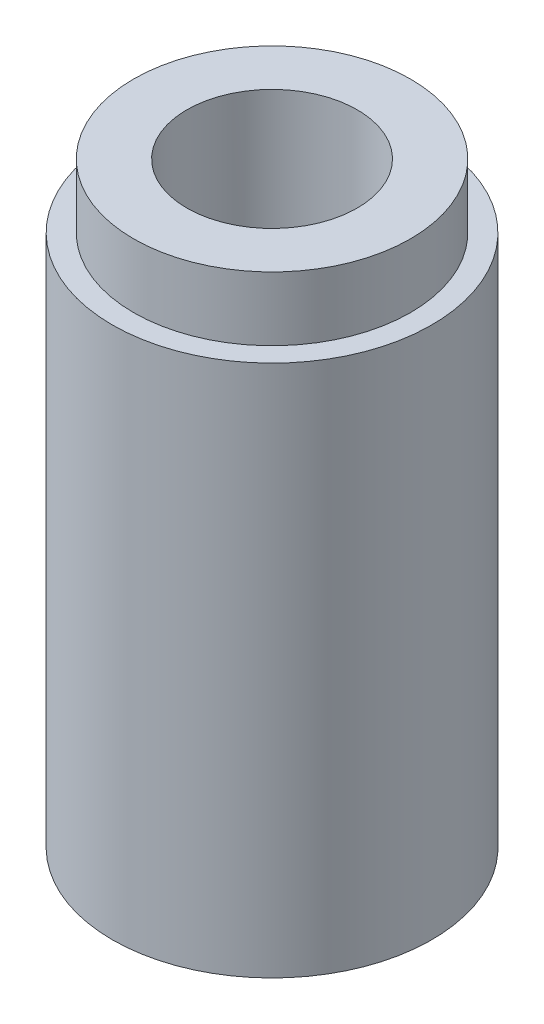
ISO-10303-21;
HEADER;
FILE_DESCRIPTION(('STEP AP214'),'2;1');
FILE_NAME('part.step','',(''),(''),'','','');
FILE_SCHEMA(('AUTOMOTIVE_DESIGN { 1 0 10303 214 1 1 1 1 }'));
ENDSEC;
DATA;
#1=APPLICATION_CONTEXT('core data for automotive mechanical design processes');
#2=APPLICATION_PROTOCOL_DEFINITION('international standard','automotive_design',2000,#1);
#3=PRODUCT_CONTEXT('',#1,'mechanical');
#4=PRODUCT('Part','Part','',(#3));
#5=PRODUCT_RELATED_PRODUCT_CATEGORY('part','',(#4));
#6=PRODUCT_DEFINITION_FORMATION('','',#4);
#7=PRODUCT_DEFINITION_CONTEXT('part definition',#1,'design');
#8=PRODUCT_DEFINITION('design','',#6,#7);
#9=PRODUCT_DEFINITION_SHAPE('','',#8);
#10=(LENGTH_UNIT() NAMED_UNIT(*) SI_UNIT(.MILLI.,.METRE.));
#11=(NAMED_UNIT(*) PLANE_ANGLE_UNIT() SI_UNIT($,.RADIAN.));
#12=(NAMED_UNIT(*) SI_UNIT($,.STERADIAN.) SOLID_ANGLE_UNIT());
#13=UNCERTAINTY_MEASURE_WITH_UNIT(LENGTH_MEASURE(1.E-05),#10,'distance_accuracy_value','');
#14=(GEOMETRIC_REPRESENTATION_CONTEXT(3) GLOBAL_UNCERTAINTY_ASSIGNED_CONTEXT((#13)) GLOBAL_UNIT_ASSIGNED_CONTEXT((#10,
#11,#12)) REPRESENTATION_CONTEXT('',''));
#15=CARTESIAN_POINT('',(0.,0.,0.));
#16=DIRECTION('',(0.,0.,1.));
#17=DIRECTION('',(1.,0.,0.));
#18=AXIS2_PLACEMENT_3D('',#15,#16,#17);
#19=CARTESIAN_POINT('',(0.,25.,0.));
#20=DIRECTION('',(0.,-1.,0.));
#21=DIRECTION('',(0.,0.,-1.));
#22=AXIS2_PLACEMENT_3D('',#19,#20,#21);
#23=CYLINDRICAL_SURFACE('',#22,7.5);
#24=CARTESIAN_POINT('',(0.,25.,0.));
#25=DIRECTION('',(0.,1.,0.));
#26=DIRECTION('',(0.,0.,1.));
#27=AXIS2_PLACEMENT_3D('',#24,#25,#26);
#28=CIRCLE('',#27,7.5);
#29=CARTESIAN_POINT('',(0.,25.,7.5));
#30=VERTEX_POINT('',#29);
#31=EDGE_CURVE('E37',#30,#30,#28,.T.);
#32=ORIENTED_EDGE('',*,*,#31,.F.);
#33=EDGE_LOOP('',(#32));
#34=FACE_BOUND('',#33,.T.);
#35=CARTESIAN_POINT('',(0.,0.,0.));
#36=DIRECTION('',(0.,1.,0.));
#37=DIRECTION('',(0.,0.,1.));
#38=AXIS2_PLACEMENT_3D('',#35,#36,#37);
#39=CIRCLE('',#38,7.5);
#40=CARTESIAN_POINT('',(0.,0.,7.5));
#41=VERTEX_POINT('',#40);
#42=EDGE_CURVE('E42',#41,#41,#39,.T.);
#43=ORIENTED_EDGE('',*,*,#42,.T.);
#44=EDGE_LOOP('',(#43));
#45=FACE_BOUND('',#44,.T.);
#46=ADVANCED_FACE('F30',(#34,#45),#23,.T.);
#47=CARTESIAN_POINT('',(0.,25.,0.));
#48=DIRECTION('',(0.,1.,0.));
#49=DIRECTION('',(0.,0.,1.));
#50=AXIS2_PLACEMENT_3D('',#47,#48,#49);
#51=PLANE('',#50);
#52=CARTESIAN_POINT('',(0.,25.,0.));
#53=DIRECTION('',(0.,1.,0.));
#54=DIRECTION('',(0.,0.,1.));
#55=AXIS2_PLACEMENT_3D('',#52,#53,#54);
#56=CIRCLE('',#55,6.5);
#57=CARTESIAN_POINT('',(0.,25.,6.5));
#58=VERTEX_POINT('',#57);
#59=EDGE_CURVE('E10',#58,#58,#56,.T.);
#60=ORIENTED_EDGE('',*,*,#59,.F.);
#61=EDGE_LOOP('',(#60));
#62=FACE_BOUND('',#61,.T.);
#63=ORIENTED_EDGE('',*,*,#31,.T.);
#64=EDGE_LOOP('',(#63));
#65=FACE_BOUND('',#64,.T.);
#66=ADVANCED_FACE('F83',(#62,#65),#51,.T.);
#67=CARTESIAN_POINT('',(0.,0.,0.));
#68=DIRECTION('',(0.,1.,0.));
#69=DIRECTION('',(0.,0.,1.));
#70=AXIS2_PLACEMENT_3D('',#67,#68,#69);
#71=PLANE('',#70);
#72=CARTESIAN_POINT('',(0.,0.,0.));
#73=DIRECTION('',(0.,-1.,0.));
#74=DIRECTION('',(0.,0.,-1.));
#75=AXIS2_PLACEMENT_3D('',#72,#73,#74);
#76=CIRCLE('',#75,5.1);
#77=CARTESIAN_POINT('',(0.,0.,-5.1));
#78=VERTEX_POINT('',#77);
#79=EDGE_CURVE('E55',#78,#78,#76,.T.);
#80=ORIENTED_EDGE('',*,*,#79,.F.);
#81=EDGE_LOOP('',(#80));
#82=FACE_BOUND('',#81,.T.);
#83=ORIENTED_EDGE('',*,*,#42,.F.);
#84=EDGE_LOOP('',(#83));
#85=FACE_BOUND('',#84,.T.);
#86=ADVANCED_FACE('F88',(#82,#85),#71,.F.);
#87=CARTESIAN_POINT('',(0.,28.,0.));
#88=DIRECTION('',(0.,-1.,0.));
#89=DIRECTION('',(0.,0.,-1.));
#90=AXIS2_PLACEMENT_3D('',#87,#88,#89);
#91=CYLINDRICAL_SURFACE('',#90,6.5);
#92=CARTESIAN_POINT('',(0.,28.,0.));
#93=DIRECTION('',(0.,1.,0.));
#94=DIRECTION('',(0.,0.,1.));
#95=AXIS2_PLACEMENT_3D('',#92,#93,#94);
#96=CIRCLE('',#95,6.5);
#97=CARTESIAN_POINT('',(0.,28.,6.5));
#98=VERTEX_POINT('',#97);
#99=EDGE_CURVE('E45',#98,#98,#96,.T.);
#100=ORIENTED_EDGE('',*,*,#99,.F.);
#101=EDGE_LOOP('',(#100));
#102=FACE_BOUND('',#101,.T.);
#103=ORIENTED_EDGE('',*,*,#59,.T.);
#104=EDGE_LOOP('',(#103));
#105=FACE_BOUND('',#104,.T.);
#106=ADVANCED_FACE('F96',(#102,#105),#91,.T.);
#107=CARTESIAN_POINT('',(0.,28.,0.));
#108=DIRECTION('',(0.,1.,0.));
#109=DIRECTION('',(0.,0.,1.));
#110=AXIS2_PLACEMENT_3D('',#107,#108,#109);
#111=PLANE('',#110);
#112=CARTESIAN_POINT('',(0.,28.,0.));
#113=DIRECTION('',(0.,1.,0.));
#114=DIRECTION('',(0.,0.,1.));
#115=AXIS2_PLACEMENT_3D('',#112,#113,#114);
#116=CIRCLE('',#115,4.);
#117=CARTESIAN_POINT('',(0.,28.,4.));
#118=VERTEX_POINT('',#117);
#119=EDGE_CURVE('E61',#118,#118,#116,.T.);
#120=ORIENTED_EDGE('',*,*,#119,.F.);
#121=EDGE_LOOP('',(#120));
#122=FACE_BOUND('',#121,.T.);
#123=ORIENTED_EDGE('',*,*,#99,.T.);
#124=EDGE_LOOP('',(#123));
#125=FACE_BOUND('',#124,.T.);
#126=ADVANCED_FACE('F79',(#122,#125),#111,.T.);
#127=CARTESIAN_POINT('',(0.,7.,0.));
#128=DIRECTION('',(0.,-1.,0.));
#129=DIRECTION('',(0.,0.,-1.));
#130=AXIS2_PLACEMENT_3D('',#127,#128,#129);
#131=CYLINDRICAL_SURFACE('',#130,5.1);
#132=CARTESIAN_POINT('',(0.,7.,0.));
#133=DIRECTION('',(0.,-1.,0.));
#134=DIRECTION('',(0.,0.,-1.));
#135=AXIS2_PLACEMENT_3D('',#132,#133,#134);
#136=CIRCLE('',#135,5.1);
#137=CARTESIAN_POINT('',(0.,7.,-5.1));
#138=VERTEX_POINT('',#137);
#139=EDGE_CURVE('E51',#138,#138,#136,.T.);
#140=ORIENTED_EDGE('',*,*,#139,.F.);
#141=EDGE_LOOP('',(#140));
#142=FACE_BOUND('',#141,.T.);
#143=ORIENTED_EDGE('',*,*,#79,.T.);
#144=EDGE_LOOP('',(#143));
#145=FACE_BOUND('',#144,.T.);
#146=ADVANCED_FACE('F72',(#142,#145),#131,.F.);
#147=CARTESIAN_POINT('',(0.,7.,0.));
#148=DIRECTION('',(0.,-1.,0.));
#149=DIRECTION('',(0.,0.,-1.));
#150=AXIS2_PLACEMENT_3D('',#147,#148,#149);
#151=PLANE('',#150);
#152=CARTESIAN_POINT('',(0.,7.,0.));
#153=DIRECTION('',(0.,-1.,0.));
#154=DIRECTION('',(0.,0.,-1.));
#155=AXIS2_PLACEMENT_3D('',#152,#153,#154);
#156=CIRCLE('',#155,4.);
#157=CARTESIAN_POINT('',(0.,7.,-4.));
#158=VERTEX_POINT('',#157);
#159=EDGE_CURVE('E33',#158,#158,#156,.T.);
#160=ORIENTED_EDGE('',*,*,#159,.F.);
#161=EDGE_LOOP('',(#160));
#162=FACE_BOUND('',#161,.T.);
#163=ORIENTED_EDGE('',*,*,#139,.T.);
#164=EDGE_LOOP('',(#163));
#165=FACE_BOUND('',#164,.T.);
#166=ADVANCED_FACE('F70',(#162,#165),#151,.T.);
#167=CARTESIAN_POINT('',(0.,0.,0.));
#168=DIRECTION('',(0.,1.,0.));
#169=DIRECTION('',(0.,0.,1.));
#170=AXIS2_PLACEMENT_3D('',#167,#168,#169);
#171=CYLINDRICAL_SURFACE('',#170,4.);
#172=ORIENTED_EDGE('',*,*,#159,.T.);
#173=EDGE_LOOP('',(#172));
#174=FACE_BOUND('',#173,.T.);
#175=ORIENTED_EDGE('',*,*,#119,.T.);
#176=EDGE_LOOP('',(#175));
#177=FACE_BOUND('',#176,.T.);
#178=ADVANCED_FACE('F68',(#174,#177),#171,.F.);
#179=CLOSED_SHELL('',(#46,#66,#86,#106,#126,#146,#166,#178));
#180=MANIFOLD_SOLID_BREP('B2',#179);
#181=ADVANCED_BREP_SHAPE_REPRESENTATION('',(#18,#180),#14);
#182=SHAPE_DEFINITION_REPRESENTATION(#9,#181);
ENDSEC;
END-ISO-10303-21;
